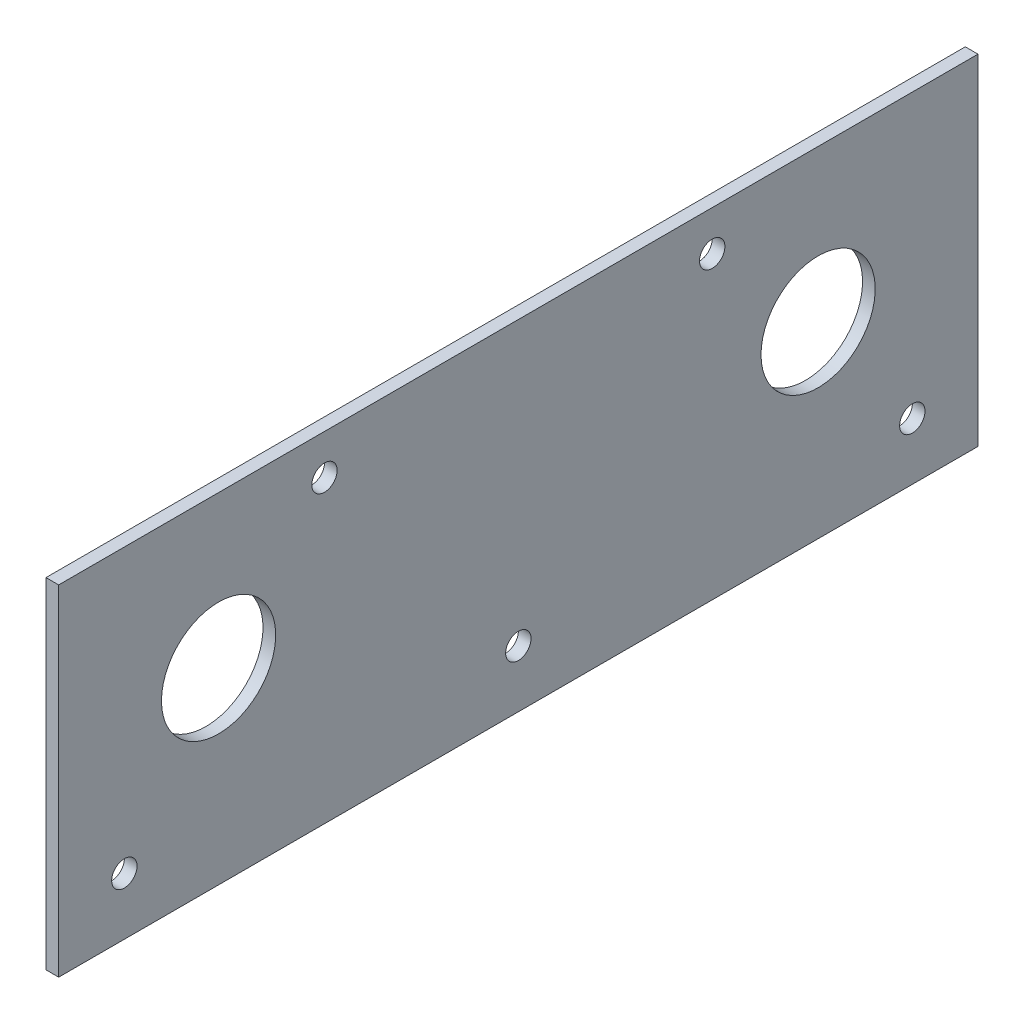
ISO-10303-21;
HEADER;
FILE_DESCRIPTION(('STEP AP214'),'2;1');
FILE_NAME('part.step','',(''),(''),'','','');
FILE_SCHEMA(('AUTOMOTIVE_DESIGN { 1 0 10303 214 1 1 1 1 }'));
ENDSEC;
DATA;
#1=APPLICATION_CONTEXT('core data for automotive mechanical design processes');
#2=APPLICATION_PROTOCOL_DEFINITION('international standard','automotive_design',2000,#1);
#3=PRODUCT_CONTEXT('',#1,'mechanical');
#4=PRODUCT('Part','Part','',(#3));
#5=PRODUCT_RELATED_PRODUCT_CATEGORY('part','',(#4));
#6=PRODUCT_DEFINITION_FORMATION('','',#4);
#7=PRODUCT_DEFINITION_CONTEXT('part definition',#1,'design');
#8=PRODUCT_DEFINITION('design','',#6,#7);
#9=PRODUCT_DEFINITION_SHAPE('','',#8);
#10=(LENGTH_UNIT() NAMED_UNIT(*) SI_UNIT(.MILLI.,.METRE.));
#11=(NAMED_UNIT(*) PLANE_ANGLE_UNIT() SI_UNIT($,.RADIAN.));
#12=(NAMED_UNIT(*) SI_UNIT($,.STERADIAN.) SOLID_ANGLE_UNIT());
#13=UNCERTAINTY_MEASURE_WITH_UNIT(LENGTH_MEASURE(1.E-05),#10,'distance_accuracy_value','');
#14=(GEOMETRIC_REPRESENTATION_CONTEXT(3) GLOBAL_UNCERTAINTY_ASSIGNED_CONTEXT((#13)) GLOBAL_UNIT_ASSIGNED_CONTEXT((#10,
#11,#12)) REPRESENTATION_CONTEXT('',''));
#15=CARTESIAN_POINT('',(0.,0.,0.));
#16=DIRECTION('',(0.,0.,1.));
#17=DIRECTION('',(1.,0.,0.));
#18=AXIS2_PLACEMENT_3D('',#15,#16,#17);
#19=CARTESIAN_POINT('',(3.175,0.,0.));
#20=DIRECTION('',(1.,0.,0.));
#21=DIRECTION('',(0.,0.,-1.));
#22=AXIS2_PLACEMENT_3D('',#19,#20,#21);
#23=PLANE('',#22);
#24=CARTESIAN_POINT('',(3.175,4.50000000000001,-75.));
#25=DIRECTION('',(-1.,0.,0.));
#26=DIRECTION('',(0.,0.,1.));
#27=AXIS2_PLACEMENT_3D('',#24,#25,#26);
#28=CIRCLE('',#27,14.2875);
#29=CARTESIAN_POINT('',(3.175,4.50000000000001,-60.7125));
#30=VERTEX_POINT('',#29);
#31=EDGE_CURVE('E101',#30,#30,#28,.T.);
#32=ORIENTED_EDGE('',*,*,#31,.T.);
#33=EDGE_LOOP('',(#32));
#34=FACE_BOUND('',#33,.T.);
#35=CARTESIAN_POINT('',(3.175,4.50000000000001,75.));
#36=DIRECTION('',(-1.,0.,0.));
#37=DIRECTION('',(0.,0.,1.));
#38=AXIS2_PLACEMENT_3D('',#35,#36,#37);
#39=CIRCLE('',#38,14.2875);
#40=CARTESIAN_POINT('',(3.175,4.50000000000001,89.2875));
#41=VERTEX_POINT('',#40);
#42=EDGE_CURVE('E104',#41,#41,#39,.T.);
#43=ORIENTED_EDGE('',*,*,#42,.T.);
#44=EDGE_LOOP('',(#43));
#45=FACE_BOUND('',#44,.T.);
#46=CARTESIAN_POINT('',(3.175,32.5,-48.5));
#47=DIRECTION('',(-1.,0.,0.));
#48=DIRECTION('',(0.,0.,1.));
#49=AXIS2_PLACEMENT_3D('',#46,#47,#48);
#50=CIRCLE('',#49,3.175);
#51=CARTESIAN_POINT('',(3.175,32.5,-45.325));
#52=VERTEX_POINT('',#51);
#53=EDGE_CURVE('E107',#52,#52,#50,.T.);
#54=ORIENTED_EDGE('',*,*,#53,.T.);
#55=EDGE_LOOP('',(#54));
#56=FACE_BOUND('',#55,.T.);
#57=CARTESIAN_POINT('',(3.175,32.5,48.5));
#58=DIRECTION('',(-1.,0.,0.));
#59=DIRECTION('',(0.,0.,1.));
#60=AXIS2_PLACEMENT_3D('',#57,#58,#59);
#61=CIRCLE('',#60,3.175);
#62=CARTESIAN_POINT('',(3.175,32.5,51.675));
#63=VERTEX_POINT('',#62);
#64=EDGE_CURVE('E110',#63,#63,#61,.T.);
#65=ORIENTED_EDGE('',*,*,#64,.T.);
#66=EDGE_LOOP('',(#65));
#67=FACE_BOUND('',#66,.T.);
#68=CARTESIAN_POINT('',(3.175,-28.212,-98.571));
#69=DIRECTION('',(-1.,0.,0.));
#70=DIRECTION('',(0.,0.,1.));
#71=AXIS2_PLACEMENT_3D('',#68,#69,#70);
#72=CIRCLE('',#71,3.17499999999999);
#73=CARTESIAN_POINT('',(3.175,-28.212,-95.396));
#74=VERTEX_POINT('',#73);
#75=EDGE_CURVE('E113',#74,#74,#72,.T.);
#76=ORIENTED_EDGE('',*,*,#75,.T.);
#77=EDGE_LOOP('',(#76));
#78=FACE_BOUND('',#77,.T.);
#79=CARTESIAN_POINT('',(3.175,-28.212,98.571));
#80=DIRECTION('',(-1.,0.,0.));
#81=DIRECTION('',(0.,0.,1.));
#82=AXIS2_PLACEMENT_3D('',#79,#80,#81);
#83=CIRCLE('',#82,3.17500000000001);
#84=CARTESIAN_POINT('',(3.175,-28.212,101.746));
#85=VERTEX_POINT('',#84);
#86=EDGE_CURVE('E115',#85,#85,#83,.T.);
#87=ORIENTED_EDGE('',*,*,#86,.T.);
#88=EDGE_LOOP('',(#87));
#89=FACE_BOUND('',#88,.T.);
#90=CARTESIAN_POINT('',(3.175,-28.212,0.));
#91=DIRECTION('',(-1.,0.,0.));
#92=DIRECTION('',(0.,0.,1.));
#93=AXIS2_PLACEMENT_3D('',#90,#91,#92);
#94=CIRCLE('',#93,3.175);
#95=CARTESIAN_POINT('',(3.175,-28.212,3.175));
#96=VERTEX_POINT('',#95);
#97=EDGE_CURVE('E20',#96,#96,#94,.T.);
#98=ORIENTED_EDGE('',*,*,#97,.T.);
#99=EDGE_LOOP('',(#98));
#100=FACE_BOUND('',#99,.T.);
#101=DIRECTION('',(0.,1.,0.));
#102=VECTOR('',#101,1.);
#103=CARTESIAN_POINT('',(3.175,-42.5,-115.));
#104=LINE('',#103,#102);
#105=CARTESIAN_POINT('',(3.175,42.5,-115.));
#106=VERTEX_POINT('',#105);
#107=CARTESIAN_POINT('',(3.175,-42.5,-115.));
#108=VERTEX_POINT('',#107);
#109=EDGE_CURVE('E59',#106,#108,#104,.F.);
#110=ORIENTED_EDGE('',*,*,#109,.F.);
#111=DIRECTION('',(0.,0.,1.));
#112=VECTOR('',#111,1.);
#113=CARTESIAN_POINT('',(3.175,42.5,-115.));
#114=LINE('',#113,#112);
#115=CARTESIAN_POINT('',(3.175,42.5,115.));
#116=VERTEX_POINT('',#115);
#117=EDGE_CURVE('E54',#116,#106,#114,.F.);
#118=ORIENTED_EDGE('',*,*,#117,.F.);
#119=DIRECTION('',(0.,1.,0.));
#120=VECTOR('',#119,1.);
#121=CARTESIAN_POINT('',(3.175,42.5,115.));
#122=LINE('',#121,#120);
#123=CARTESIAN_POINT('',(3.175,-42.5,115.));
#124=VERTEX_POINT('',#123);
#125=EDGE_CURVE('E71',#124,#116,#122,.T.);
#126=ORIENTED_EDGE('',*,*,#125,.F.);
#127=DIRECTION('',(0.,0.,-1.));
#128=VECTOR('',#127,1.);
#129=CARTESIAN_POINT('',(3.175,-42.5,115.));
#130=LINE('',#129,#128);
#131=EDGE_CURVE('E68',#108,#124,#130,.F.);
#132=ORIENTED_EDGE('',*,*,#131,.F.);
#133=EDGE_LOOP('',(#110,#118,#126,#132));
#134=FACE_BOUND('',#133,.T.);
#135=ADVANCED_FACE('F17',(#34,#45,#56,#67,#78,#89,#100,#134),#23,.T.);
#136=CARTESIAN_POINT('',(0.,-42.5,115.));
#137=DIRECTION('',(0.,-1.,0.));
#138=DIRECTION('',(0.,0.,-1.));
#139=AXIS2_PLACEMENT_3D('',#136,#137,#138);
#140=PLANE('',#139);
#141=ORIENTED_EDGE('',*,*,#131,.T.);
#142=DIRECTION('',(1.,0.,0.));
#143=VECTOR('',#142,1.);
#144=CARTESIAN_POINT('',(0.,-42.5,115.));
#145=LINE('',#144,#143);
#146=CARTESIAN_POINT('',(0.,-42.5,115.));
#147=VERTEX_POINT('',#146);
#148=EDGE_CURVE('E123',#147,#124,#145,.T.);
#149=ORIENTED_EDGE('',*,*,#148,.F.);
#150=DIRECTION('',(0.,0.,-1.));
#151=VECTOR('',#150,1.);
#152=CARTESIAN_POINT('',(0.,-42.5,0.));
#153=LINE('',#152,#151);
#154=CARTESIAN_POINT('',(0.,-42.5,-115.));
#155=VERTEX_POINT('',#154);
#156=EDGE_CURVE('E78',#147,#155,#153,.T.);
#157=ORIENTED_EDGE('',*,*,#156,.T.);
#158=DIRECTION('',(-1.,0.,0.));
#159=VECTOR('',#158,1.);
#160=CARTESIAN_POINT('',(0.,-42.5,-115.));
#161=LINE('',#160,#159);
#162=EDGE_CURVE('E64',#108,#155,#161,.T.);
#163=ORIENTED_EDGE('',*,*,#162,.F.);
#164=EDGE_LOOP('',(#141,#149,#157,#163));
#165=FACE_BOUND('',#164,.T.);
#166=ADVANCED_FACE('F77',(#165),#140,.T.);
#167=CARTESIAN_POINT('',(0.,-42.5,-115.));
#168=DIRECTION('',(0.,0.,-1.));
#169=DIRECTION('',(-1.,0.,0.));
#170=AXIS2_PLACEMENT_3D('',#167,#168,#169);
#171=PLANE('',#170);
#172=ORIENTED_EDGE('',*,*,#109,.T.);
#173=ORIENTED_EDGE('',*,*,#162,.T.);
#174=DIRECTION('',(0.,1.,0.));
#175=VECTOR('',#174,1.);
#176=CARTESIAN_POINT('',(0.,0.,-115.));
#177=LINE('',#176,#175);
#178=CARTESIAN_POINT('',(0.,42.5,-115.));
#179=VERTEX_POINT('',#178);
#180=EDGE_CURVE('E134',#155,#179,#177,.T.);
#181=ORIENTED_EDGE('',*,*,#180,.T.);
#182=DIRECTION('',(1.,0.,0.));
#183=VECTOR('',#182,1.);
#184=CARTESIAN_POINT('',(0.,42.5,-115.));
#185=LINE('',#184,#183);
#186=EDGE_CURVE('E66',#106,#179,#185,.F.);
#187=ORIENTED_EDGE('',*,*,#186,.F.);
#188=EDGE_LOOP('',(#172,#173,#181,#187));
#189=FACE_BOUND('',#188,.T.);
#190=ADVANCED_FACE('F61',(#189),#171,.T.);
#191=CARTESIAN_POINT('',(0.,42.5,-115.));
#192=DIRECTION('',(0.,1.,0.));
#193=DIRECTION('',(0.,0.,1.));
#194=AXIS2_PLACEMENT_3D('',#191,#192,#193);
#195=PLANE('',#194);
#196=ORIENTED_EDGE('',*,*,#117,.T.);
#197=ORIENTED_EDGE('',*,*,#186,.T.);
#198=DIRECTION('',(0.,0.,-1.));
#199=VECTOR('',#198,1.);
#200=CARTESIAN_POINT('',(0.,42.5,0.));
#201=LINE('',#200,#199);
#202=CARTESIAN_POINT('',(0.,42.5,115.));
#203=VERTEX_POINT('',#202);
#204=EDGE_CURVE('E131',#179,#203,#201,.F.);
#205=ORIENTED_EDGE('',*,*,#204,.T.);
#206=DIRECTION('',(1.,0.,0.));
#207=VECTOR('',#206,1.);
#208=CARTESIAN_POINT('',(0.,42.5,115.));
#209=LINE('',#208,#207);
#210=EDGE_CURVE('E35',#116,#203,#209,.F.);
#211=ORIENTED_EDGE('',*,*,#210,.F.);
#212=EDGE_LOOP('',(#196,#197,#205,#211));
#213=FACE_BOUND('',#212,.T.);
#214=ADVANCED_FACE('F130',(#213),#195,.T.);
#215=CARTESIAN_POINT('',(0.,42.5,115.));
#216=DIRECTION('',(0.,0.,1.));
#217=DIRECTION('',(1.,0.,0.));
#218=AXIS2_PLACEMENT_3D('',#215,#216,#217);
#219=PLANE('',#218);
#220=ORIENTED_EDGE('',*,*,#125,.T.);
#221=ORIENTED_EDGE('',*,*,#210,.T.);
#222=DIRECTION('',(0.,1.,0.));
#223=VECTOR('',#222,1.);
#224=CARTESIAN_POINT('',(0.,0.,115.));
#225=LINE('',#224,#223);
#226=EDGE_CURVE('E100',#203,#147,#225,.F.);
#227=ORIENTED_EDGE('',*,*,#226,.T.);
#228=ORIENTED_EDGE('',*,*,#148,.T.);
#229=EDGE_LOOP('',(#220,#221,#227,#228));
#230=FACE_BOUND('',#229,.T.);
#231=ADVANCED_FACE('F137',(#230),#219,.T.);
#232=CARTESIAN_POINT('',(3.175,-28.212,0.));
#233=DIRECTION('',(-1.,0.,0.));
#234=DIRECTION('',(0.,0.,1.));
#235=AXIS2_PLACEMENT_3D('',#232,#233,#234);
#236=CYLINDRICAL_SURFACE('',#235,3.175);
#237=CARTESIAN_POINT('',(0.,-28.212,0.));
#238=DIRECTION('',(-1.,0.,0.));
#239=DIRECTION('',(0.,0.,1.));
#240=AXIS2_PLACEMENT_3D('',#237,#238,#239);
#241=CIRCLE('',#240,3.175);
#242=CARTESIAN_POINT('',(0.,-28.212,3.175));
#243=VERTEX_POINT('',#242);
#244=EDGE_CURVE('E97',#243,#243,#241,.T.);
#245=ORIENTED_EDGE('',*,*,#244,.T.);
#246=EDGE_LOOP('',(#245));
#247=FACE_BOUND('',#246,.T.);
#248=ORIENTED_EDGE('',*,*,#97,.F.);
#249=EDGE_LOOP('',(#248));
#250=FACE_BOUND('',#249,.T.);
#251=ADVANCED_FACE('F139',(#247,#250),#236,.F.);
#252=CARTESIAN_POINT('',(3.175,-28.212,98.571));
#253=DIRECTION('',(-1.,0.,0.));
#254=DIRECTION('',(0.,0.,1.));
#255=AXIS2_PLACEMENT_3D('',#252,#253,#254);
#256=CYLINDRICAL_SURFACE('',#255,3.17500000000001);
#257=CARTESIAN_POINT('',(0.,-28.212,98.571));
#258=DIRECTION('',(-1.,0.,0.));
#259=DIRECTION('',(0.,0.,1.));
#260=AXIS2_PLACEMENT_3D('',#257,#258,#259);
#261=CIRCLE('',#260,3.17500000000001);
#262=CARTESIAN_POINT('',(0.,-28.212,101.746));
#263=VERTEX_POINT('',#262);
#264=EDGE_CURVE('E94',#263,#263,#261,.T.);
#265=ORIENTED_EDGE('',*,*,#264,.T.);
#266=EDGE_LOOP('',(#265));
#267=FACE_BOUND('',#266,.T.);
#268=ORIENTED_EDGE('',*,*,#86,.F.);
#269=EDGE_LOOP('',(#268));
#270=FACE_BOUND('',#269,.T.);
#271=ADVANCED_FACE('F146',(#267,#270),#256,.F.);
#272=CARTESIAN_POINT('',(3.175,-28.212,-98.571));
#273=DIRECTION('',(-1.,0.,0.));
#274=DIRECTION('',(0.,0.,1.));
#275=AXIS2_PLACEMENT_3D('',#272,#273,#274);
#276=CYLINDRICAL_SURFACE('',#275,3.17499999999999);
#277=CARTESIAN_POINT('',(0.,-28.212,-98.571));
#278=DIRECTION('',(-1.,0.,0.));
#279=DIRECTION('',(0.,0.,1.));
#280=AXIS2_PLACEMENT_3D('',#277,#278,#279);
#281=CIRCLE('',#280,3.17499999999999);
#282=CARTESIAN_POINT('',(0.,-28.212,-95.396));
#283=VERTEX_POINT('',#282);
#284=EDGE_CURVE('E91',#283,#283,#281,.T.);
#285=ORIENTED_EDGE('',*,*,#284,.T.);
#286=EDGE_LOOP('',(#285));
#287=FACE_BOUND('',#286,.T.);
#288=ORIENTED_EDGE('',*,*,#75,.F.);
#289=EDGE_LOOP('',(#288));
#290=FACE_BOUND('',#289,.T.);
#291=ADVANCED_FACE('F173',(#287,#290),#276,.F.);
#292=CARTESIAN_POINT('',(3.175,32.5,48.5));
#293=DIRECTION('',(-1.,0.,0.));
#294=DIRECTION('',(0.,0.,1.));
#295=AXIS2_PLACEMENT_3D('',#292,#293,#294);
#296=CYLINDRICAL_SURFACE('',#295,3.175);
#297=CARTESIAN_POINT('',(0.,32.5,48.5));
#298=DIRECTION('',(-1.,0.,0.));
#299=DIRECTION('',(0.,0.,1.));
#300=AXIS2_PLACEMENT_3D('',#297,#298,#299);
#301=CIRCLE('',#300,3.175);
#302=CARTESIAN_POINT('',(0.,32.5,51.675));
#303=VERTEX_POINT('',#302);
#304=EDGE_CURVE('E88',#303,#303,#301,.T.);
#305=ORIENTED_EDGE('',*,*,#304,.T.);
#306=EDGE_LOOP('',(#305));
#307=FACE_BOUND('',#306,.T.);
#308=ORIENTED_EDGE('',*,*,#64,.F.);
#309=EDGE_LOOP('',(#308));
#310=FACE_BOUND('',#309,.T.);
#311=ADVANCED_FACE('F169',(#307,#310),#296,.F.);
#312=CARTESIAN_POINT('',(3.175,32.5,-48.5));
#313=DIRECTION('',(-1.,0.,0.));
#314=DIRECTION('',(0.,0.,1.));
#315=AXIS2_PLACEMENT_3D('',#312,#313,#314);
#316=CYLINDRICAL_SURFACE('',#315,3.175);
#317=CARTESIAN_POINT('',(0.,32.5,-48.5));
#318=DIRECTION('',(-1.,0.,0.));
#319=DIRECTION('',(0.,0.,1.));
#320=AXIS2_PLACEMENT_3D('',#317,#318,#319);
#321=CIRCLE('',#320,3.175);
#322=CARTESIAN_POINT('',(0.,32.5,-45.325));
#323=VERTEX_POINT('',#322);
#324=EDGE_CURVE('E85',#323,#323,#321,.T.);
#325=ORIENTED_EDGE('',*,*,#324,.T.);
#326=EDGE_LOOP('',(#325));
#327=FACE_BOUND('',#326,.T.);
#328=ORIENTED_EDGE('',*,*,#53,.F.);
#329=EDGE_LOOP('',(#328));
#330=FACE_BOUND('',#329,.T.);
#331=ADVANCED_FACE('F165',(#327,#330),#316,.F.);
#332=CARTESIAN_POINT('',(3.175,4.50000000000001,75.));
#333=DIRECTION('',(-1.,0.,0.));
#334=DIRECTION('',(0.,0.,1.));
#335=AXIS2_PLACEMENT_3D('',#332,#333,#334);
#336=CYLINDRICAL_SURFACE('',#335,14.2875);
#337=CARTESIAN_POINT('',(0.,4.50000000000001,75.));
#338=DIRECTION('',(-1.,0.,0.));
#339=DIRECTION('',(0.,0.,1.));
#340=AXIS2_PLACEMENT_3D('',#337,#338,#339);
#341=CIRCLE('',#340,14.2875);
#342=CARTESIAN_POINT('',(0.,4.50000000000001,89.2875));
#343=VERTEX_POINT('',#342);
#344=EDGE_CURVE('E26',#343,#343,#341,.T.);
#345=ORIENTED_EDGE('',*,*,#344,.T.);
#346=EDGE_LOOP('',(#345));
#347=FACE_BOUND('',#346,.T.);
#348=ORIENTED_EDGE('',*,*,#42,.F.);
#349=EDGE_LOOP('',(#348));
#350=FACE_BOUND('',#349,.T.);
#351=ADVANCED_FACE('F157',(#347,#350),#336,.F.);
#352=CARTESIAN_POINT('',(3.175,4.50000000000001,-75.));
#353=DIRECTION('',(-1.,0.,0.));
#354=DIRECTION('',(0.,0.,1.));
#355=AXIS2_PLACEMENT_3D('',#352,#353,#354);
#356=CYLINDRICAL_SURFACE('',#355,14.2875);
#357=CARTESIAN_POINT('',(0.,4.50000000000001,-75.));
#358=DIRECTION('',(-1.,0.,0.));
#359=DIRECTION('',(0.,0.,1.));
#360=AXIS2_PLACEMENT_3D('',#357,#358,#359);
#361=CIRCLE('',#360,14.2875);
#362=CARTESIAN_POINT('',(0.,4.50000000000001,-60.7125));
#363=VERTEX_POINT('',#362);
#364=EDGE_CURVE('E11',#363,#363,#361,.T.);
#365=ORIENTED_EDGE('',*,*,#364,.T.);
#366=EDGE_LOOP('',(#365));
#367=FACE_BOUND('',#366,.T.);
#368=ORIENTED_EDGE('',*,*,#31,.F.);
#369=EDGE_LOOP('',(#368));
#370=FACE_BOUND('',#369,.T.);
#371=ADVANCED_FACE('F151',(#367,#370),#356,.F.);
#372=CARTESIAN_POINT('',(0.,0.,0.));
#373=DIRECTION('',(1.,0.,0.));
#374=DIRECTION('',(0.,0.,-1.));
#375=AXIS2_PLACEMENT_3D('',#372,#373,#374);
#376=PLANE('',#375);
#377=ORIENTED_EDGE('',*,*,#364,.F.);
#378=EDGE_LOOP('',(#377));
#379=FACE_BOUND('',#378,.T.);
#380=ORIENTED_EDGE('',*,*,#344,.F.);
#381=EDGE_LOOP('',(#380));
#382=FACE_BOUND('',#381,.T.);
#383=ORIENTED_EDGE('',*,*,#324,.F.);
#384=EDGE_LOOP('',(#383));
#385=FACE_BOUND('',#384,.T.);
#386=ORIENTED_EDGE('',*,*,#304,.F.);
#387=EDGE_LOOP('',(#386));
#388=FACE_BOUND('',#387,.T.);
#389=ORIENTED_EDGE('',*,*,#284,.F.);
#390=EDGE_LOOP('',(#389));
#391=FACE_BOUND('',#390,.T.);
#392=ORIENTED_EDGE('',*,*,#264,.F.);
#393=EDGE_LOOP('',(#392));
#394=FACE_BOUND('',#393,.T.);
#395=ORIENTED_EDGE('',*,*,#244,.F.);
#396=EDGE_LOOP('',(#395));
#397=FACE_BOUND('',#396,.T.);
#398=ORIENTED_EDGE('',*,*,#204,.F.);
#399=ORIENTED_EDGE('',*,*,#180,.F.);
#400=ORIENTED_EDGE('',*,*,#156,.F.);
#401=ORIENTED_EDGE('',*,*,#226,.F.);
#402=EDGE_LOOP('',(#398,#399,#400,#401));
#403=FACE_BOUND('',#402,.T.);
#404=ADVANCED_FACE('F133',(#379,#382,#385,#388,#391,#394,#397,#403),#376,.F.);
#405=CLOSED_SHELL('',(#135,#166,#190,#214,#231,#251,#271,#291,#311,#331,#351,#371,#404));
#406=MANIFOLD_SOLID_BREP('B1',#405);
#407=ADVANCED_BREP_SHAPE_REPRESENTATION('',(#18,#406),#14);
#408=SHAPE_DEFINITION_REPRESENTATION(#9,#407);
ENDSEC;
END-ISO-10303-21;
